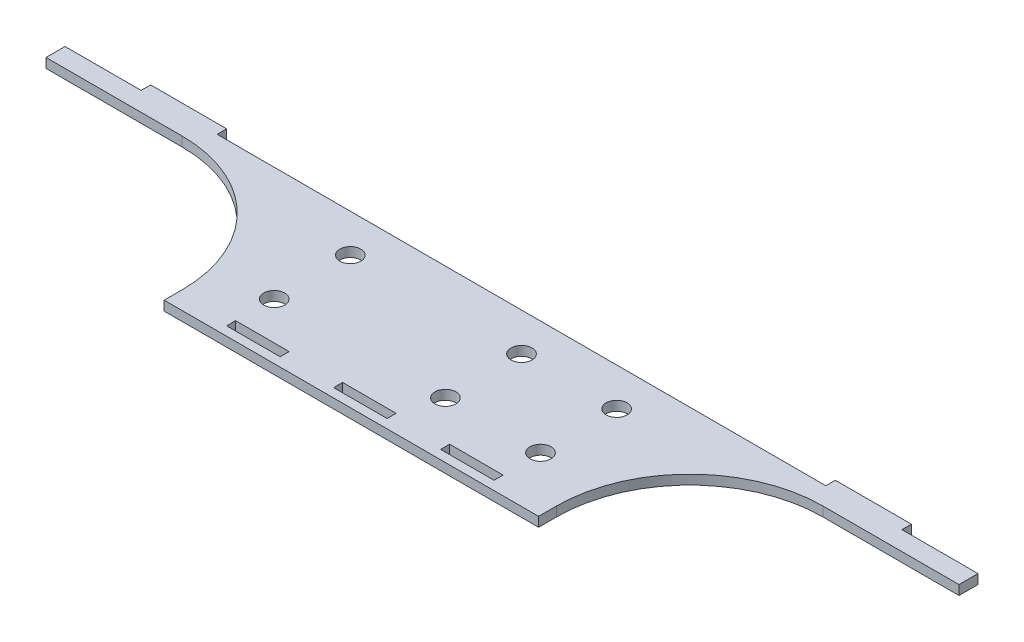
ISO-10303-21;
HEADER;
FILE_DESCRIPTION(('STEP AP214'),'2;1');
FILE_NAME('part.step','',(''),(''),'','','');
FILE_SCHEMA(('AUTOMOTIVE_DESIGN { 1 0 10303 214 1 1 1 1 }'));
ENDSEC;
DATA;
#1=APPLICATION_CONTEXT('core data for automotive mechanical design processes');
#2=APPLICATION_PROTOCOL_DEFINITION('international standard','automotive_design',2000,#1);
#3=PRODUCT_CONTEXT('',#1,'mechanical');
#4=PRODUCT('Part','Part','',(#3));
#5=PRODUCT_RELATED_PRODUCT_CATEGORY('part','',(#4));
#6=PRODUCT_DEFINITION_FORMATION('','',#4);
#7=PRODUCT_DEFINITION_CONTEXT('part definition',#1,'design');
#8=PRODUCT_DEFINITION('design','',#6,#7);
#9=PRODUCT_DEFINITION_SHAPE('','',#8);
#10=(LENGTH_UNIT() NAMED_UNIT(*) SI_UNIT(.MILLI.,.METRE.));
#11=(NAMED_UNIT(*) PLANE_ANGLE_UNIT() SI_UNIT($,.RADIAN.));
#12=(NAMED_UNIT(*) SI_UNIT($,.STERADIAN.) SOLID_ANGLE_UNIT());
#13=UNCERTAINTY_MEASURE_WITH_UNIT(LENGTH_MEASURE(1.E-05),#10,'distance_accuracy_value','');
#14=(GEOMETRIC_REPRESENTATION_CONTEXT(3) GLOBAL_UNCERTAINTY_ASSIGNED_CONTEXT((#13)) GLOBAL_UNIT_ASSIGNED_CONTEXT((#10,
#11,#12)) REPRESENTATION_CONTEXT('',''));
#15=CARTESIAN_POINT('',(0.,0.,0.));
#16=DIRECTION('',(0.,0.,1.));
#17=DIRECTION('',(1.,0.,0.));
#18=AXIS2_PLACEMENT_3D('',#15,#16,#17);
#19=CARTESIAN_POINT('',(106.95,3.175,25.4));
#20=DIRECTION('',(0.,-1.,0.));
#21=DIRECTION('',(0.,0.,-1.));
#22=AXIS2_PLACEMENT_3D('',#19,#20,#21);
#23=CYLINDRICAL_SURFACE('',#22,44.45);
#24=CARTESIAN_POINT('',(106.95,0.,25.4));
#25=DIRECTION('',(0.,1.,0.));
#26=DIRECTION('',(0.,0.,1.));
#27=AXIS2_PLACEMENT_3D('',#24,#25,#26);
#28=CIRCLE('',#27,44.45);
#29=CARTESIAN_POINT('',(106.95,0.,-19.05));
#30=VERTEX_POINT('',#29);
#31=CARTESIAN_POINT('',(62.5,0.,25.4));
#32=VERTEX_POINT('',#31);
#33=EDGE_CURVE('E329',#30,#32,#28,.T.);
#34=ORIENTED_EDGE('',*,*,#33,.F.);
#35=DIRECTION('',(0.,-1.,0.));
#36=VECTOR('',#35,1.);
#37=CARTESIAN_POINT('',(106.95,3.175,-19.05));
#38=LINE('',#37,#36);
#39=CARTESIAN_POINT('',(106.95,3.175,-19.05));
#40=VERTEX_POINT('',#39);
#41=EDGE_CURVE('E11',#40,#30,#38,.T.);
#42=ORIENTED_EDGE('',*,*,#41,.F.);
#43=CARTESIAN_POINT('',(106.95,3.175,25.4));
#44=DIRECTION('',(0.,1.,0.));
#45=DIRECTION('',(0.,0.,1.));
#46=AXIS2_PLACEMENT_3D('',#43,#44,#45);
#47=CIRCLE('',#46,44.45);
#48=CARTESIAN_POINT('',(62.5,3.175,25.4));
#49=VERTEX_POINT('',#48);
#50=EDGE_CURVE('E987',#40,#49,#47,.T.);
#51=ORIENTED_EDGE('',*,*,#50,.T.);
#52=DIRECTION('',(0.,-1.,0.));
#53=VECTOR('',#52,1.);
#54=CARTESIAN_POINT('',(62.5,3.175,25.4));
#55=LINE('',#54,#53);
#56=EDGE_CURVE('E161',#49,#32,#55,.T.);
#57=ORIENTED_EDGE('',*,*,#56,.T.);
#58=EDGE_LOOP('',(#34,#42,#51,#57));
#59=FACE_BOUND('',#58,.T.);
#60=ADVANCED_FACE('F41',(#59),#23,.F.);
#61=CARTESIAN_POINT('',(0.,3.175,-19.0499999999999));
#62=DIRECTION('',(0.,0.,1.));
#63=DIRECTION('',(1.,0.,0.));
#64=AXIS2_PLACEMENT_3D('',#61,#62,#63);
#65=PLANE('',#64);
#66=DIRECTION('',(-1.,0.,0.));
#67=VECTOR('',#66,1.);
#68=CARTESIAN_POINT('',(0.,0.,-19.0499999999999));
#69=LINE('',#68,#67);
#70=CARTESIAN_POINT('',(152.4,0.,-19.05));
#71=VERTEX_POINT('',#70);
#72=EDGE_CURVE('E331',#71,#30,#69,.T.);
#73=ORIENTED_EDGE('',*,*,#72,.F.);
#74=DIRECTION('',(0.,-1.,0.));
#75=VECTOR('',#74,1.);
#76=CARTESIAN_POINT('',(152.4,3.175,-19.05));
#77=LINE('',#76,#75);
#78=CARTESIAN_POINT('',(152.4,3.175,-19.05));
#79=VERTEX_POINT('',#78);
#80=EDGE_CURVE('E51',#79,#71,#77,.T.);
#81=ORIENTED_EDGE('',*,*,#80,.F.);
#82=DIRECTION('',(-1.,0.,0.));
#83=VECTOR('',#82,1.);
#84=CARTESIAN_POINT('',(0.,3.175,-19.0499999999999));
#85=LINE('',#84,#83);
#86=EDGE_CURVE('E593',#79,#40,#85,.T.);
#87=ORIENTED_EDGE('',*,*,#86,.T.);
#88=ORIENTED_EDGE('',*,*,#41,.T.);
#89=EDGE_LOOP('',(#73,#81,#87,#88));
#90=FACE_BOUND('',#89,.T.);
#91=ADVANCED_FACE('F456',(#90),#65,.T.);
#92=CARTESIAN_POINT('',(152.4,3.175,0.));
#93=DIRECTION('',(-1.,0.,0.));
#94=DIRECTION('',(0.,0.,1.));
#95=AXIS2_PLACEMENT_3D('',#92,#93,#94);
#96=PLANE('',#95);
#97=DIRECTION('',(0.,0.,-1.));
#98=VECTOR('',#97,1.);
#99=CARTESIAN_POINT('',(152.4,0.,0.));
#100=LINE('',#99,#98);
#101=CARTESIAN_POINT('',(152.4,0.,-25.4));
#102=VERTEX_POINT('',#101);
#103=EDGE_CURVE('E334',#71,#102,#100,.T.);
#104=ORIENTED_EDGE('',*,*,#103,.T.);
#105=DIRECTION('',(0.,-1.,0.));
#106=VECTOR('',#105,1.);
#107=CARTESIAN_POINT('',(152.4,3.175,-25.4));
#108=LINE('',#107,#106);
#109=CARTESIAN_POINT('',(152.4,3.175,-25.4));
#110=VERTEX_POINT('',#109);
#111=EDGE_CURVE('E400',#110,#102,#108,.T.);
#112=ORIENTED_EDGE('',*,*,#111,.F.);
#113=DIRECTION('',(0.,0.,-1.));
#114=VECTOR('',#113,1.);
#115=CARTESIAN_POINT('',(152.4,3.175,0.));
#116=LINE('',#115,#114);
#117=EDGE_CURVE('E587',#79,#110,#116,.T.);
#118=ORIENTED_EDGE('',*,*,#117,.F.);
#119=ORIENTED_EDGE('',*,*,#80,.T.);
#120=EDGE_LOOP('',(#104,#112,#118,#119));
#121=FACE_BOUND('',#120,.T.);
#122=ADVANCED_FACE('F461',(#121),#96,.F.);
#123=CARTESIAN_POINT('',(0.,3.175,-25.4));
#124=DIRECTION('',(0.,0.,-1.));
#125=DIRECTION('',(-1.,0.,0.));
#126=AXIS2_PLACEMENT_3D('',#123,#124,#125);
#127=PLANE('',#126);
#128=DIRECTION('',(1.,0.,0.));
#129=VECTOR('',#128,1.);
#130=CARTESIAN_POINT('',(0.,0.,-25.4));
#131=LINE('',#130,#129);
#132=CARTESIAN_POINT('',(127.,0.,-25.4));
#133=VERTEX_POINT('',#132);
#134=EDGE_CURVE('E337',#133,#102,#131,.T.);
#135=ORIENTED_EDGE('',*,*,#134,.F.);
#136=DIRECTION('',(0.,-1.,0.));
#137=VECTOR('',#136,1.);
#138=CARTESIAN_POINT('',(127.,3.175,-25.4));
#139=LINE('',#138,#137);
#140=CARTESIAN_POINT('',(127.,3.175,-25.4));
#141=VERTEX_POINT('',#140);
#142=EDGE_CURVE('E398',#141,#133,#139,.T.);
#143=ORIENTED_EDGE('',*,*,#142,.F.);
#144=DIRECTION('',(1.,0.,0.));
#145=VECTOR('',#144,1.);
#146=CARTESIAN_POINT('',(0.,3.175,-25.4));
#147=LINE('',#146,#145);
#148=EDGE_CURVE('E583',#141,#110,#147,.T.);
#149=ORIENTED_EDGE('',*,*,#148,.T.);
#150=ORIENTED_EDGE('',*,*,#111,.T.);
#151=EDGE_LOOP('',(#135,#143,#149,#150));
#152=FACE_BOUND('',#151,.T.);
#153=ADVANCED_FACE('F545',(#152),#127,.T.);
#154=CARTESIAN_POINT('',(127.,3.175,0.));
#155=DIRECTION('',(1.,0.,0.));
#156=DIRECTION('',(0.,0.,-1.));
#157=AXIS2_PLACEMENT_3D('',#154,#155,#156);
#158=PLANE('',#157);
#159=DIRECTION('',(0.,0.,1.));
#160=VECTOR('',#159,1.);
#161=CARTESIAN_POINT('',(127.,0.,0.));
#162=LINE('',#161,#160);
#163=CARTESIAN_POINT('',(127.,0.,-28.575));
#164=VERTEX_POINT('',#163);
#165=EDGE_CURVE('E340',#164,#133,#162,.T.);
#166=ORIENTED_EDGE('',*,*,#165,.F.);
#167=DIRECTION('',(0.,-1.,0.));
#168=VECTOR('',#167,1.);
#169=CARTESIAN_POINT('',(127.,3.175,-28.575));
#170=LINE('',#169,#168);
#171=CARTESIAN_POINT('',(127.,3.175,-28.575));
#172=VERTEX_POINT('',#171);
#173=EDGE_CURVE('E396',#172,#164,#170,.T.);
#174=ORIENTED_EDGE('',*,*,#173,.F.);
#175=DIRECTION('',(0.,0.,1.));
#176=VECTOR('',#175,1.);
#177=CARTESIAN_POINT('',(127.,3.175,0.));
#178=LINE('',#177,#176);
#179=EDGE_CURVE('E586',#172,#141,#178,.T.);
#180=ORIENTED_EDGE('',*,*,#179,.T.);
#181=ORIENTED_EDGE('',*,*,#142,.T.);
#182=EDGE_LOOP('',(#166,#174,#180,#181));
#183=FACE_BOUND('',#182,.T.);
#184=ADVANCED_FACE('F565',(#183),#158,.T.);
#185=CARTESIAN_POINT('',(0.,3.175,-28.575));
#186=DIRECTION('',(0.,0.,-1.));
#187=DIRECTION('',(-1.,0.,0.));
#188=AXIS2_PLACEMENT_3D('',#185,#186,#187);
#189=PLANE('',#188);
#190=DIRECTION('',(1.,0.,0.));
#191=VECTOR('',#190,1.);
#192=CARTESIAN_POINT('',(0.,0.,-28.575));
#193=LINE('',#192,#191);
#194=CARTESIAN_POINT('',(101.6,0.,-28.575));
#195=VERTEX_POINT('',#194);
#196=EDGE_CURVE('E345',#195,#164,#193,.T.);
#197=ORIENTED_EDGE('',*,*,#196,.F.);
#198=DIRECTION('',(0.,-1.,0.));
#199=VECTOR('',#198,1.);
#200=CARTESIAN_POINT('',(101.6,3.175,-28.575));
#201=LINE('',#200,#199);
#202=CARTESIAN_POINT('',(101.6,3.175,-28.575));
#203=VERTEX_POINT('',#202);
#204=EDGE_CURVE('E394',#203,#195,#201,.T.);
#205=ORIENTED_EDGE('',*,*,#204,.F.);
#206=DIRECTION('',(1.,0.,0.));
#207=VECTOR('',#206,1.);
#208=CARTESIAN_POINT('',(0.,3.175,-28.575));
#209=LINE('',#208,#207);
#210=EDGE_CURVE('E591',#203,#172,#209,.T.);
#211=ORIENTED_EDGE('',*,*,#210,.T.);
#212=ORIENTED_EDGE('',*,*,#173,.T.);
#213=EDGE_LOOP('',(#197,#205,#211,#212));
#214=FACE_BOUND('',#213,.T.);
#215=ADVANCED_FACE('F561',(#214),#189,.T.);
#216=CARTESIAN_POINT('',(101.6,3.175,0.));
#217=DIRECTION('',(1.,0.,0.));
#218=DIRECTION('',(0.,0.,-1.));
#219=AXIS2_PLACEMENT_3D('',#216,#217,#218);
#220=PLANE('',#219);
#221=DIRECTION('',(0.,0.,1.));
#222=VECTOR('',#221,1.);
#223=CARTESIAN_POINT('',(101.6,0.,0.));
#224=LINE('',#223,#222);
#225=CARTESIAN_POINT('',(101.6,0.,-25.4));
#226=VERTEX_POINT('',#225);
#227=EDGE_CURVE('E348',#195,#226,#224,.T.);
#228=ORIENTED_EDGE('',*,*,#227,.T.);
#229=DIRECTION('',(0.,-1.,0.));
#230=VECTOR('',#229,1.);
#231=CARTESIAN_POINT('',(101.6,3.175,-25.4));
#232=LINE('',#231,#230);
#233=CARTESIAN_POINT('',(101.6,3.175,-25.4));
#234=VERTEX_POINT('',#233);
#235=EDGE_CURVE('E392',#234,#226,#232,.T.);
#236=ORIENTED_EDGE('',*,*,#235,.F.);
#237=DIRECTION('',(0.,0.,1.));
#238=VECTOR('',#237,1.);
#239=CARTESIAN_POINT('',(101.6,3.175,0.));
#240=LINE('',#239,#238);
#241=EDGE_CURVE('E600',#203,#234,#240,.T.);
#242=ORIENTED_EDGE('',*,*,#241,.F.);
#243=ORIENTED_EDGE('',*,*,#204,.T.);
#244=EDGE_LOOP('',(#228,#236,#242,#243));
#245=FACE_BOUND('',#244,.T.);
#246=ADVANCED_FACE('F558',(#245),#220,.F.);
#247=CARTESIAN_POINT('',(-101.6,0.,-25.4));
#248=VERTEX_POINT('',#247);
#249=EDGE_CURVE('E342',#248,#226,#131,.T.);
#250=ORIENTED_EDGE('',*,*,#249,.F.);
#251=DIRECTION('',(0.,-1.,0.));
#252=VECTOR('',#251,1.);
#253=CARTESIAN_POINT('',(-101.6,3.175,-25.4));
#254=LINE('',#253,#252);
#255=CARTESIAN_POINT('',(-101.6,3.175,-25.4));
#256=VERTEX_POINT('',#255);
#257=EDGE_CURVE('E390',#256,#248,#254,.T.);
#258=ORIENTED_EDGE('',*,*,#257,.F.);
#259=EDGE_CURVE('E590',#256,#234,#147,.T.);
#260=ORIENTED_EDGE('',*,*,#259,.T.);
#261=ORIENTED_EDGE('',*,*,#235,.T.);
#262=EDGE_LOOP('',(#250,#258,#260,#261));
#263=FACE_BOUND('',#262,.T.);
#264=ADVANCED_FACE('F546',(#263),#127,.T.);
#265=CARTESIAN_POINT('',(-101.6,3.175,1.77635683940024E-12));
#266=DIRECTION('',(1.,0.,0.));
#267=DIRECTION('',(0.,0.,-1.));
#268=AXIS2_PLACEMENT_3D('',#265,#266,#267);
#269=PLANE('',#268);
#270=DIRECTION('',(0.,0.,1.));
#271=VECTOR('',#270,1.);
#272=CARTESIAN_POINT('',(-101.6,0.,1.77635683940024E-12));
#273=LINE('',#272,#271);
#274=CARTESIAN_POINT('',(-101.6,0.,-28.575));
#275=VERTEX_POINT('',#274);
#276=EDGE_CURVE('E351',#275,#248,#273,.T.);
#277=ORIENTED_EDGE('',*,*,#276,.F.);
#278=DIRECTION('',(0.,-1.,0.));
#279=VECTOR('',#278,1.);
#280=CARTESIAN_POINT('',(-101.6,3.175,-28.575));
#281=LINE('',#280,#279);
#282=CARTESIAN_POINT('',(-101.6,3.175,-28.575));
#283=VERTEX_POINT('',#282);
#284=EDGE_CURVE('E388',#283,#275,#281,.T.);
#285=ORIENTED_EDGE('',*,*,#284,.F.);
#286=DIRECTION('',(0.,0.,1.));
#287=VECTOR('',#286,1.);
#288=CARTESIAN_POINT('',(-101.6,3.175,1.77635683940024E-12));
#289=LINE('',#288,#287);
#290=EDGE_CURVE('E599',#283,#256,#289,.T.);
#291=ORIENTED_EDGE('',*,*,#290,.T.);
#292=ORIENTED_EDGE('',*,*,#257,.T.);
#293=EDGE_LOOP('',(#277,#285,#291,#292));
#294=FACE_BOUND('',#293,.T.);
#295=ADVANCED_FACE('F553',(#294),#269,.T.);
#296=CARTESIAN_POINT('',(0.,3.175,-28.575));
#297=DIRECTION('',(0.,0.,-1.));
#298=DIRECTION('',(-1.,0.,0.));
#299=AXIS2_PLACEMENT_3D('',#296,#297,#298);
#300=PLANE('',#299);
#301=DIRECTION('',(1.,0.,0.));
#302=VECTOR('',#301,1.);
#303=CARTESIAN_POINT('',(0.,0.,-28.575));
#304=LINE('',#303,#302);
#305=CARTESIAN_POINT('',(-127.,0.,-28.575));
#306=VERTEX_POINT('',#305);
#307=EDGE_CURVE('E354',#306,#275,#304,.T.);
#308=ORIENTED_EDGE('',*,*,#307,.F.);
#309=DIRECTION('',(0.,-1.,0.));
#310=VECTOR('',#309,1.);
#311=CARTESIAN_POINT('',(-127.,3.175,-28.575));
#312=LINE('',#311,#310);
#313=CARTESIAN_POINT('',(-127.,3.175,-28.575));
#314=VERTEX_POINT('',#313);
#315=EDGE_CURVE('E386',#314,#306,#312,.T.);
#316=ORIENTED_EDGE('',*,*,#315,.F.);
#317=DIRECTION('',(1.,0.,0.));
#318=VECTOR('',#317,1.);
#319=CARTESIAN_POINT('',(0.,3.175,-28.575));
#320=LINE('',#319,#318);
#321=EDGE_CURVE('E604',#314,#283,#320,.T.);
#322=ORIENTED_EDGE('',*,*,#321,.T.);
#323=ORIENTED_EDGE('',*,*,#284,.T.);
#324=EDGE_LOOP('',(#308,#316,#322,#323));
#325=FACE_BOUND('',#324,.T.);
#326=ADVANCED_FACE('F549',(#325),#300,.T.);
#327=CARTESIAN_POINT('',(-127.,3.175,1.11022302462515E-12));
#328=DIRECTION('',(1.,0.,0.));
#329=DIRECTION('',(0.,0.,-1.));
#330=AXIS2_PLACEMENT_3D('',#327,#328,#329);
#331=PLANE('',#330);
#332=DIRECTION('',(0.,0.,1.));
#333=VECTOR('',#332,1.);
#334=CARTESIAN_POINT('',(-127.,0.,1.11022302462515E-12));
#335=LINE('',#334,#333);
#336=CARTESIAN_POINT('',(-127.,0.,-25.4));
#337=VERTEX_POINT('',#336);
#338=EDGE_CURVE('E357',#306,#337,#335,.T.);
#339=ORIENTED_EDGE('',*,*,#338,.T.);
#340=DIRECTION('',(0.,-1.,0.));
#341=VECTOR('',#340,1.);
#342=CARTESIAN_POINT('',(-127.,3.175,-25.4));
#343=LINE('',#342,#341);
#344=CARTESIAN_POINT('',(-127.,3.175,-25.4));
#345=VERTEX_POINT('',#344);
#346=EDGE_CURVE('E384',#345,#337,#343,.T.);
#347=ORIENTED_EDGE('',*,*,#346,.F.);
#348=DIRECTION('',(0.,0.,1.));
#349=VECTOR('',#348,1.);
#350=CARTESIAN_POINT('',(-127.,3.175,1.11022302462515E-12));
#351=LINE('',#350,#349);
#352=EDGE_CURVE('E597',#314,#345,#351,.T.);
#353=ORIENTED_EDGE('',*,*,#352,.F.);
#354=ORIENTED_EDGE('',*,*,#315,.T.);
#355=EDGE_LOOP('',(#339,#347,#353,#354));
#356=FACE_BOUND('',#355,.T.);
#357=ADVANCED_FACE('F543',(#356),#331,.F.);
#358=CARTESIAN_POINT('',(-152.4,0.,-25.4));
#359=VERTEX_POINT('',#358);
#360=EDGE_CURVE('E341',#359,#337,#131,.T.);
#361=ORIENTED_EDGE('',*,*,#360,.F.);
#362=DIRECTION('',(0.,-1.,0.));
#363=VECTOR('',#362,1.);
#364=CARTESIAN_POINT('',(-152.4,3.175,-25.4));
#365=LINE('',#364,#363);
#366=CARTESIAN_POINT('',(-152.4,3.175,-25.4));
#367=VERTEX_POINT('',#366);
#368=EDGE_CURVE('E382',#367,#359,#365,.T.);
#369=ORIENTED_EDGE('',*,*,#368,.F.);
#370=EDGE_CURVE('E589',#367,#345,#147,.T.);
#371=ORIENTED_EDGE('',*,*,#370,.T.);
#372=ORIENTED_EDGE('',*,*,#346,.T.);
#373=EDGE_LOOP('',(#361,#369,#371,#372));
#374=FACE_BOUND('',#373,.T.);
#375=ADVANCED_FACE('F539',(#374),#127,.T.);
#376=CARTESIAN_POINT('',(-152.4,3.175,0.));
#377=DIRECTION('',(-1.,0.,0.));
#378=DIRECTION('',(0.,0.,1.));
#379=AXIS2_PLACEMENT_3D('',#376,#377,#378);
#380=PLANE('',#379);
#381=DIRECTION('',(0.,0.,-1.));
#382=VECTOR('',#381,1.);
#383=CARTESIAN_POINT('',(-152.4,0.,0.));
#384=LINE('',#383,#382);
#385=CARTESIAN_POINT('',(-152.4,0.,-19.05));
#386=VERTEX_POINT('',#385);
#387=EDGE_CURVE('E360',#386,#359,#384,.T.);
#388=ORIENTED_EDGE('',*,*,#387,.F.);
#389=DIRECTION('',(0.,-1.,0.));
#390=VECTOR('',#389,1.);
#391=CARTESIAN_POINT('',(-152.4,3.175,-19.05));
#392=LINE('',#391,#390);
#393=CARTESIAN_POINT('',(-152.4,3.175,-19.05));
#394=VERTEX_POINT('',#393);
#395=EDGE_CURVE('E380',#394,#386,#392,.T.);
#396=ORIENTED_EDGE('',*,*,#395,.F.);
#397=DIRECTION('',(0.,0.,-1.));
#398=VECTOR('',#397,1.);
#399=CARTESIAN_POINT('',(-152.4,3.175,0.));
#400=LINE('',#399,#398);
#401=EDGE_CURVE('E596',#394,#367,#400,.T.);
#402=ORIENTED_EDGE('',*,*,#401,.T.);
#403=ORIENTED_EDGE('',*,*,#368,.T.);
#404=EDGE_LOOP('',(#388,#396,#402,#403));
#405=FACE_BOUND('',#404,.T.);
#406=ADVANCED_FACE('F535',(#405),#380,.T.);
#407=CARTESIAN_POINT('',(0.,3.175,-19.05));
#408=DIRECTION('',(0.,0.,1.));
#409=DIRECTION('',(1.,0.,0.));
#410=AXIS2_PLACEMENT_3D('',#407,#408,#409);
#411=PLANE('',#410);
#412=DIRECTION('',(-1.,0.,0.));
#413=VECTOR('',#412,1.);
#414=CARTESIAN_POINT('',(0.,0.,-19.05));
#415=LINE('',#414,#413);
#416=CARTESIAN_POINT('',(-106.95,0.,-19.05));
#417=VERTEX_POINT('',#416);
#418=EDGE_CURVE('E363',#417,#386,#415,.T.);
#419=ORIENTED_EDGE('',*,*,#418,.F.);
#420=DIRECTION('',(0.,-1.,0.));
#421=VECTOR('',#420,1.);
#422=CARTESIAN_POINT('',(-106.95,3.175,-19.05));
#423=LINE('',#422,#421);
#424=CARTESIAN_POINT('',(-106.95,3.175,-19.05));
#425=VERTEX_POINT('',#424);
#426=EDGE_CURVE('E378',#425,#417,#423,.T.);
#427=ORIENTED_EDGE('',*,*,#426,.F.);
#428=DIRECTION('',(-1.,0.,0.));
#429=VECTOR('',#428,1.);
#430=CARTESIAN_POINT('',(0.,3.175,-19.05));
#431=LINE('',#430,#429);
#432=EDGE_CURVE('E273',#425,#394,#431,.T.);
#433=ORIENTED_EDGE('',*,*,#432,.T.);
#434=ORIENTED_EDGE('',*,*,#395,.T.);
#435=EDGE_LOOP('',(#419,#427,#433,#434));
#436=FACE_BOUND('',#435,.T.);
#437=ADVANCED_FACE('F531',(#436),#411,.T.);
#438=CARTESIAN_POINT('',(-106.95,3.175,25.4));
#439=DIRECTION('',(0.,-1.,0.));
#440=DIRECTION('',(0.,0.,-1.));
#441=AXIS2_PLACEMENT_3D('',#438,#439,#440);
#442=CYLINDRICAL_SURFACE('',#441,44.45);
#443=CARTESIAN_POINT('',(-106.95,0.,25.4));
#444=DIRECTION('',(0.,1.,0.));
#445=DIRECTION('',(0.,0.,1.));
#446=AXIS2_PLACEMENT_3D('',#443,#444,#445);
#447=CIRCLE('',#446,44.45);
#448=CARTESIAN_POINT('',(-62.5,0.,25.4));
#449=VERTEX_POINT('',#448);
#450=EDGE_CURVE('E366',#417,#449,#447,.F.);
#451=ORIENTED_EDGE('',*,*,#450,.T.);
#452=DIRECTION('',(0.,-1.,0.));
#453=VECTOR('',#452,1.);
#454=CARTESIAN_POINT('',(-62.5,3.175,25.4));
#455=LINE('',#454,#453);
#456=CARTESIAN_POINT('',(-62.5,3.175,25.4));
#457=VERTEX_POINT('',#456);
#458=EDGE_CURVE('E260',#457,#449,#455,.T.);
#459=ORIENTED_EDGE('',*,*,#458,.F.);
#460=CARTESIAN_POINT('',(-106.95,3.175,25.4));
#461=DIRECTION('',(0.,1.,0.));
#462=DIRECTION('',(0.,0.,1.));
#463=AXIS2_PLACEMENT_3D('',#460,#461,#462);
#464=CIRCLE('',#463,44.45);
#465=EDGE_CURVE('E270',#425,#457,#464,.F.);
#466=ORIENTED_EDGE('',*,*,#465,.F.);
#467=ORIENTED_EDGE('',*,*,#426,.T.);
#468=EDGE_LOOP('',(#451,#459,#466,#467));
#469=FACE_BOUND('',#468,.T.);
#470=ADVANCED_FACE('F528',(#469),#442,.F.);
#471=CARTESIAN_POINT('',(-62.4999999999999,3.175,-3.61400724161833E-13));
#472=DIRECTION('',(-1.,0.,0.));
#473=DIRECTION('',(0.,0.,1.));
#474=AXIS2_PLACEMENT_3D('',#471,#472,#473);
#475=PLANE('',#474);
#476=DIRECTION('',(0.,0.,-1.));
#477=VECTOR('',#476,1.);
#478=CARTESIAN_POINT('',(-62.4999999999999,0.,-3.61400724161833E-13));
#479=LINE('',#478,#477);
#480=CARTESIAN_POINT('',(-62.5,0.,31.4));
#481=VERTEX_POINT('',#480);
#482=EDGE_CURVE('E257',#481,#449,#479,.T.);
#483=ORIENTED_EDGE('',*,*,#482,.F.);
#484=DIRECTION('',(0.,-1.,0.));
#485=VECTOR('',#484,1.);
#486=CARTESIAN_POINT('',(-62.5,3.175,31.4));
#487=LINE('',#486,#485);
#488=CARTESIAN_POINT('',(-62.5,3.175,31.4));
#489=VERTEX_POINT('',#488);
#490=EDGE_CURVE('E251',#489,#481,#487,.T.);
#491=ORIENTED_EDGE('',*,*,#490,.F.);
#492=DIRECTION('',(0.,0.,-1.));
#493=VECTOR('',#492,1.);
#494=CARTESIAN_POINT('',(-62.4999999999999,3.175,-3.61400724161833E-13));
#495=LINE('',#494,#493);
#496=EDGE_CURVE('E255',#489,#457,#495,.T.);
#497=ORIENTED_EDGE('',*,*,#496,.T.);
#498=ORIENTED_EDGE('',*,*,#458,.T.);
#499=EDGE_LOOP('',(#483,#491,#497,#498));
#500=FACE_BOUND('',#499,.T.);
#501=ADVANCED_FACE('F253',(#500),#475,.T.);
#502=CARTESIAN_POINT('',(0.,3.175,31.4));
#503=DIRECTION('',(0.,0.,-1.));
#504=DIRECTION('',(-1.,0.,0.));
#505=AXIS2_PLACEMENT_3D('',#502,#503,#504);
#506=PLANE('',#505);
#507=DIRECTION('',(1.,0.,0.));
#508=VECTOR('',#507,1.);
#509=CARTESIAN_POINT('',(0.,0.,31.4));
#510=LINE('',#509,#508);
#511=CARTESIAN_POINT('',(62.5,0.,31.4));
#512=VERTEX_POINT('',#511);
#513=EDGE_CURVE('E370',#481,#512,#510,.T.);
#514=ORIENTED_EDGE('',*,*,#513,.T.);
#515=DIRECTION('',(0.,-1.,0.));
#516=VECTOR('',#515,1.);
#517=CARTESIAN_POINT('',(62.5,3.175,31.4));
#518=LINE('',#517,#516);
#519=CARTESIAN_POINT('',(62.5,3.175,31.4));
#520=VERTEX_POINT('',#519);
#521=EDGE_CURVE('E261',#520,#512,#518,.T.);
#522=ORIENTED_EDGE('',*,*,#521,.F.);
#523=DIRECTION('',(1.,0.,0.));
#524=VECTOR('',#523,1.);
#525=CARTESIAN_POINT('',(0.,3.175,31.4));
#526=LINE('',#525,#524);
#527=EDGE_CURVE('E264',#489,#520,#526,.T.);
#528=ORIENTED_EDGE('',*,*,#527,.F.);
#529=ORIENTED_EDGE('',*,*,#490,.T.);
#530=EDGE_LOOP('',(#514,#522,#528,#529));
#531=FACE_BOUND('',#530,.T.);
#532=ADVANCED_FACE('F265',(#531),#506,.F.);
#533=CARTESIAN_POINT('',(26.7857142857143,3.175,0.));
#534=DIRECTION('',(-1.,0.,0.));
#535=DIRECTION('',(0.,0.,1.));
#536=AXIS2_PLACEMENT_3D('',#533,#534,#535);
#537=PLANE('',#536);
#538=DIRECTION('',(0.,0.,-1.));
#539=VECTOR('',#538,1.);
#540=CARTESIAN_POINT('',(26.7857142857143,0.,0.));
#541=LINE('',#540,#539);
#542=CARTESIAN_POINT('',(26.7857142857143,0.,28.4));
#543=VERTEX_POINT('',#542);
#544=CARTESIAN_POINT('',(26.7857142857143,0.,25.4));
#545=VERTEX_POINT('',#544);
#546=EDGE_CURVE('E302',#543,#545,#541,.T.);
#547=ORIENTED_EDGE('',*,*,#546,.T.);
#548=DIRECTION('',(0.,-1.,0.));
#549=VECTOR('',#548,1.);
#550=CARTESIAN_POINT('',(26.7857142857143,3.175,25.4));
#551=LINE('',#550,#549);
#552=CARTESIAN_POINT('',(26.7857142857143,3.175,25.4));
#553=VERTEX_POINT('',#552);
#554=EDGE_CURVE('E375',#553,#545,#551,.T.);
#555=ORIENTED_EDGE('',*,*,#554,.F.);
#556=DIRECTION('',(0.,0.,-1.));
#557=VECTOR('',#556,1.);
#558=CARTESIAN_POINT('',(26.7857142857143,3.175,0.));
#559=LINE('',#558,#557);
#560=CARTESIAN_POINT('',(26.7857142857143,3.175,28.4));
#561=VERTEX_POINT('',#560);
#562=EDGE_CURVE('E953',#561,#553,#559,.T.);
#563=ORIENTED_EDGE('',*,*,#562,.F.);
#564=DIRECTION('',(0.,-1.,0.));
#565=VECTOR('',#564,1.);
#566=CARTESIAN_POINT('',(26.7857142857143,3.175,28.4));
#567=LINE('',#566,#565);
#568=EDGE_CURVE('E403',#561,#543,#567,.T.);
#569=ORIENTED_EDGE('',*,*,#568,.T.);
#570=EDGE_LOOP('',(#547,#555,#563,#569));
#571=FACE_BOUND('',#570,.T.);
#572=ADVANCED_FACE('F496',(#571),#537,.F.);
#573=CARTESIAN_POINT('',(0.,3.175,25.4));
#574=DIRECTION('',(0.,0.,-1.));
#575=DIRECTION('',(-1.,0.,0.));
#576=AXIS2_PLACEMENT_3D('',#573,#574,#575);
#577=PLANE('',#576);
#578=DIRECTION('',(1.,0.,0.));
#579=VECTOR('',#578,1.);
#580=CARTESIAN_POINT('',(0.,0.,25.4));
#581=LINE('',#580,#579);
#582=CARTESIAN_POINT('',(44.6428571428572,0.,25.4));
#583=VERTEX_POINT('',#582);
#584=EDGE_CURVE('E286',#545,#583,#581,.T.);
#585=ORIENTED_EDGE('',*,*,#584,.T.);
#586=DIRECTION('',(0.,-1.,0.));
#587=VECTOR('',#586,1.);
#588=CARTESIAN_POINT('',(44.6428571428572,3.175,25.4));
#589=LINE('',#588,#587);
#590=CARTESIAN_POINT('',(44.6428571428572,3.175,25.4));
#591=VERTEX_POINT('',#590);
#592=EDGE_CURVE('E408',#591,#583,#589,.T.);
#593=ORIENTED_EDGE('',*,*,#592,.F.);
#594=DIRECTION('',(1.,0.,0.));
#595=VECTOR('',#594,1.);
#596=CARTESIAN_POINT('',(0.,3.175,25.4));
#597=LINE('',#596,#595);
#598=EDGE_CURVE('E957',#553,#591,#597,.T.);
#599=ORIENTED_EDGE('',*,*,#598,.F.);
#600=ORIENTED_EDGE('',*,*,#554,.T.);
#601=EDGE_LOOP('',(#585,#593,#599,#600));
#602=FACE_BOUND('',#601,.T.);
#603=ADVANCED_FACE('F453',(#602),#577,.F.);
#604=CARTESIAN_POINT('',(44.6428571428572,3.175,0.));
#605=DIRECTION('',(-1.,0.,0.));
#606=DIRECTION('',(0.,0.,1.));
#607=AXIS2_PLACEMENT_3D('',#604,#605,#606);
#608=PLANE('',#607);
#609=DIRECTION('',(0.,0.,-1.));
#610=VECTOR('',#609,1.);
#611=CARTESIAN_POINT('',(44.6428571428572,0.,0.));
#612=LINE('',#611,#610);
#613=CARTESIAN_POINT('',(44.6428571428572,0.,28.4));
#614=VERTEX_POINT('',#613);
#615=EDGE_CURVE('E305',#614,#583,#612,.T.);
#616=ORIENTED_EDGE('',*,*,#615,.F.);
#617=DIRECTION('',(0.,-1.,0.));
#618=VECTOR('',#617,1.);
#619=CARTESIAN_POINT('',(44.6428571428572,3.175,28.4));
#620=LINE('',#619,#618);
#621=CARTESIAN_POINT('',(44.6428571428572,3.175,28.4));
#622=VERTEX_POINT('',#621);
#623=EDGE_CURVE('E405',#622,#614,#620,.T.);
#624=ORIENTED_EDGE('',*,*,#623,.F.);
#625=DIRECTION('',(0.,0.,-1.));
#626=VECTOR('',#625,1.);
#627=CARTESIAN_POINT('',(44.6428571428572,3.175,0.));
#628=LINE('',#627,#626);
#629=EDGE_CURVE('E963',#622,#591,#628,.T.);
#630=ORIENTED_EDGE('',*,*,#629,.T.);
#631=ORIENTED_EDGE('',*,*,#592,.T.);
#632=EDGE_LOOP('',(#616,#624,#630,#631));
#633=FACE_BOUND('',#632,.T.);
#634=ADVANCED_FACE('F490',(#633),#608,.T.);
#635=CARTESIAN_POINT('',(-8.92857142857143,3.175,0.));
#636=DIRECTION('',(-1.,0.,0.));
#637=DIRECTION('',(0.,0.,1.));
#638=AXIS2_PLACEMENT_3D('',#635,#636,#637);
#639=PLANE('',#638);
#640=DIRECTION('',(0.,0.,-1.));
#641=VECTOR('',#640,1.);
#642=CARTESIAN_POINT('',(-8.92857142857143,0.,0.));
#643=LINE('',#642,#641);
#644=CARTESIAN_POINT('',(-8.92857142857143,0.,28.4));
#645=VERTEX_POINT('',#644);
#646=CARTESIAN_POINT('',(-8.92857142857143,0.,25.4));
#647=VERTEX_POINT('',#646);
#648=EDGE_CURVE('E293',#645,#647,#643,.T.);
#649=ORIENTED_EDGE('',*,*,#648,.T.);
#650=DIRECTION('',(0.,-1.,0.));
#651=VECTOR('',#650,1.);
#652=CARTESIAN_POINT('',(-8.92857142857143,3.175,25.4));
#653=LINE('',#652,#651);
#654=CARTESIAN_POINT('',(-8.92857142857143,3.175,25.4));
#655=VERTEX_POINT('',#654);
#656=EDGE_CURVE('E406',#655,#647,#653,.T.);
#657=ORIENTED_EDGE('',*,*,#656,.F.);
#658=DIRECTION('',(0.,0.,-1.));
#659=VECTOR('',#658,1.);
#660=CARTESIAN_POINT('',(-8.92857142857143,3.175,0.));
#661=LINE('',#660,#659);
#662=CARTESIAN_POINT('',(-8.92857142857143,3.175,28.4));
#663=VERTEX_POINT('',#662);
#664=EDGE_CURVE('E955',#663,#655,#661,.T.);
#665=ORIENTED_EDGE('',*,*,#664,.F.);
#666=DIRECTION('',(0.,-1.,0.));
#667=VECTOR('',#666,1.);
#668=CARTESIAN_POINT('',(-8.92857142857143,3.175,28.4));
#669=LINE('',#668,#667);
#670=EDGE_CURVE('E412',#663,#645,#669,.T.);
#671=ORIENTED_EDGE('',*,*,#670,.T.);
#672=EDGE_LOOP('',(#649,#657,#665,#671));
#673=FACE_BOUND('',#672,.T.);
#674=ADVANCED_FACE('F492',(#673),#639,.F.);
#675=CARTESIAN_POINT('',(8.92857142857143,0.,25.4));
#676=VERTEX_POINT('',#675);
#677=EDGE_CURVE('E287',#647,#676,#581,.T.);
#678=ORIENTED_EDGE('',*,*,#677,.T.);
#679=DIRECTION('',(0.,-1.,0.));
#680=VECTOR('',#679,1.);
#681=CARTESIAN_POINT('',(8.92857142857143,3.175,25.4));
#682=LINE('',#681,#680);
#683=CARTESIAN_POINT('',(8.92857142857143,3.175,25.4));
#684=VERTEX_POINT('',#683);
#685=EDGE_CURVE('E416',#684,#676,#682,.T.);
#686=ORIENTED_EDGE('',*,*,#685,.F.);
#687=EDGE_CURVE('E951',#655,#684,#597,.T.);
#688=ORIENTED_EDGE('',*,*,#687,.F.);
#689=ORIENTED_EDGE('',*,*,#656,.T.);
#690=EDGE_LOOP('',(#678,#686,#688,#689));
#691=FACE_BOUND('',#690,.T.);
#692=ADVANCED_FACE('F452',(#691),#577,.F.);
#693=CARTESIAN_POINT('',(8.92857142857144,3.175,0.));
#694=DIRECTION('',(-1.,0.,0.));
#695=DIRECTION('',(0.,0.,1.));
#696=AXIS2_PLACEMENT_3D('',#693,#694,#695);
#697=PLANE('',#696);
#698=DIRECTION('',(0.,0.,-1.));
#699=VECTOR('',#698,1.);
#700=CARTESIAN_POINT('',(8.92857142857144,0.,0.));
#701=LINE('',#700,#699);
#702=CARTESIAN_POINT('',(8.92857142857143,0.,28.4));
#703=VERTEX_POINT('',#702);
#704=EDGE_CURVE('E296',#703,#676,#701,.T.);
#705=ORIENTED_EDGE('',*,*,#704,.F.);
#706=DIRECTION('',(0.,-1.,0.));
#707=VECTOR('',#706,1.);
#708=CARTESIAN_POINT('',(8.92857142857143,3.175,28.4));
#709=LINE('',#708,#707);
#710=CARTESIAN_POINT('',(8.92857142857143,3.175,28.4));
#711=VERTEX_POINT('',#710);
#712=EDGE_CURVE('E414',#711,#703,#709,.T.);
#713=ORIENTED_EDGE('',*,*,#712,.F.);
#714=DIRECTION('',(0.,0.,-1.));
#715=VECTOR('',#714,1.);
#716=CARTESIAN_POINT('',(8.92857142857144,3.175,0.));
#717=LINE('',#716,#715);
#718=EDGE_CURVE('E946',#711,#684,#717,.T.);
#719=ORIENTED_EDGE('',*,*,#718,.T.);
#720=ORIENTED_EDGE('',*,*,#685,.T.);
#721=EDGE_LOOP('',(#705,#713,#719,#720));
#722=FACE_BOUND('',#721,.T.);
#723=ADVANCED_FACE('F504',(#722),#697,.T.);
#724=CARTESIAN_POINT('',(-44.6428571428572,3.175,0.));
#725=DIRECTION('',(-1.,0.,0.));
#726=DIRECTION('',(0.,0.,1.));
#727=AXIS2_PLACEMENT_3D('',#724,#725,#726);
#728=PLANE('',#727);
#729=DIRECTION('',(0.,0.,-1.));
#730=VECTOR('',#729,1.);
#731=CARTESIAN_POINT('',(-44.6428571428572,0.,0.));
#732=LINE('',#731,#730);
#733=CARTESIAN_POINT('',(-44.6428571428572,0.,28.4));
#734=VERTEX_POINT('',#733);
#735=CARTESIAN_POINT('',(-44.6428571428572,0.,25.4));
#736=VERTEX_POINT('',#735);
#737=EDGE_CURVE('E279',#734,#736,#732,.T.);
#738=ORIENTED_EDGE('',*,*,#737,.T.);
#739=DIRECTION('',(0.,-1.,0.));
#740=VECTOR('',#739,1.);
#741=CARTESIAN_POINT('',(-44.6428571428572,3.175,25.4));
#742=LINE('',#741,#740);
#743=CARTESIAN_POINT('',(-44.6428571428572,3.175,25.4));
#744=VERTEX_POINT('',#743);
#745=EDGE_CURVE('E45',#744,#736,#742,.T.);
#746=ORIENTED_EDGE('',*,*,#745,.F.);
#747=DIRECTION('',(0.,0.,-1.));
#748=VECTOR('',#747,1.);
#749=CARTESIAN_POINT('',(-44.6428571428572,3.175,0.));
#750=LINE('',#749,#748);
#751=CARTESIAN_POINT('',(-44.6428571428572,3.175,28.4));
#752=VERTEX_POINT('',#751);
#753=EDGE_CURVE('E373',#752,#744,#750,.T.);
#754=ORIENTED_EDGE('',*,*,#753,.F.);
#755=DIRECTION('',(0.,-1.,0.));
#756=VECTOR('',#755,1.);
#757=CARTESIAN_POINT('',(-44.6428571428572,3.175,28.4));
#758=LINE('',#757,#756);
#759=EDGE_CURVE('E278',#752,#734,#758,.T.);
#760=ORIENTED_EDGE('',*,*,#759,.T.);
#761=EDGE_LOOP('',(#738,#746,#754,#760));
#762=FACE_BOUND('',#761,.T.);
#763=ADVANCED_FACE('F43',(#762),#728,.F.);
#764=CARTESIAN_POINT('',(-26.7857142857143,0.,25.4));
#765=VERTEX_POINT('',#764);
#766=EDGE_CURVE('E282',#736,#765,#581,.T.);
#767=ORIENTED_EDGE('',*,*,#766,.T.);
#768=DIRECTION('',(0.,-1.,0.));
#769=VECTOR('',#768,1.);
#770=CARTESIAN_POINT('',(-26.7857142857143,3.175,25.4));
#771=LINE('',#770,#769);
#772=CARTESIAN_POINT('',(-26.7857142857143,3.175,25.4));
#773=VERTEX_POINT('',#772);
#774=EDGE_CURVE('E422',#773,#765,#771,.T.);
#775=ORIENTED_EDGE('',*,*,#774,.F.);
#776=EDGE_CURVE('E169',#744,#773,#597,.T.);
#777=ORIENTED_EDGE('',*,*,#776,.F.);
#778=ORIENTED_EDGE('',*,*,#745,.T.);
#779=EDGE_LOOP('',(#767,#775,#777,#778));
#780=FACE_BOUND('',#779,.T.);
#781=ADVANCED_FACE('F427',(#780),#577,.F.);
#782=CARTESIAN_POINT('',(-26.7857142857143,3.175,0.));
#783=DIRECTION('',(-1.,0.,0.));
#784=DIRECTION('',(0.,0.,1.));
#785=AXIS2_PLACEMENT_3D('',#782,#783,#784);
#786=PLANE('',#785);
#787=DIRECTION('',(0.,0.,-1.));
#788=VECTOR('',#787,1.);
#789=CARTESIAN_POINT('',(-26.7857142857143,0.,0.));
#790=LINE('',#789,#788);
#791=CARTESIAN_POINT('',(-26.7857142857143,0.,28.4));
#792=VERTEX_POINT('',#791);
#793=EDGE_CURVE('E285',#792,#765,#790,.T.);
#794=ORIENTED_EDGE('',*,*,#793,.F.);
#795=DIRECTION('',(0.,-1.,0.));
#796=VECTOR('',#795,1.);
#797=CARTESIAN_POINT('',(-26.7857142857143,3.175,28.4));
#798=LINE('',#797,#796);
#799=CARTESIAN_POINT('',(-26.7857142857143,3.175,28.4));
#800=VERTEX_POINT('',#799);
#801=EDGE_CURVE('E421',#800,#792,#798,.T.);
#802=ORIENTED_EDGE('',*,*,#801,.F.);
#803=DIRECTION('',(0.,0.,-1.));
#804=VECTOR('',#803,1.);
#805=CARTESIAN_POINT('',(-26.7857142857143,3.175,0.));
#806=LINE('',#805,#804);
#807=EDGE_CURVE('E1033',#800,#773,#806,.T.);
#808=ORIENTED_EDGE('',*,*,#807,.T.);
#809=ORIENTED_EDGE('',*,*,#774,.T.);
#810=EDGE_LOOP('',(#794,#802,#808,#809));
#811=FACE_BOUND('',#810,.T.);
#812=ADVANCED_FACE('F441',(#811),#786,.T.);
#813=CARTESIAN_POINT('',(-44.45,3.175,-12.7));
#814=DIRECTION('',(0.,-1.,0.));
#815=DIRECTION('',(0.,0.,-1.));
#816=AXIS2_PLACEMENT_3D('',#813,#814,#815);
#817=CYLINDRICAL_SURFACE('',#816,3.5);
#818=CARTESIAN_POINT('',(-44.45,3.175,-12.7));
#819=DIRECTION('',(0.,1.,0.));
#820=DIRECTION('',(0.,0.,1.));
#821=AXIS2_PLACEMENT_3D('',#818,#819,#820);
#822=CIRCLE('',#821,3.5);
#823=CARTESIAN_POINT('',(-44.45,3.175,-9.2));
#824=VERTEX_POINT('',#823);
#825=EDGE_CURVE('E984',#824,#824,#822,.T.);
#826=ORIENTED_EDGE('',*,*,#825,.T.);
#827=EDGE_LOOP('',(#826));
#828=FACE_BOUND('',#827,.T.);
#829=CARTESIAN_POINT('',(-44.45,0.,-12.7));
#830=DIRECTION('',(0.,1.,0.));
#831=DIRECTION('',(0.,0.,1.));
#832=AXIS2_PLACEMENT_3D('',#829,#830,#831);
#833=CIRCLE('',#832,3.5);
#834=CARTESIAN_POINT('',(-44.45,0.,-9.2));
#835=VERTEX_POINT('',#834);
#836=EDGE_CURVE('E326',#835,#835,#833,.T.);
#837=ORIENTED_EDGE('',*,*,#836,.F.);
#838=EDGE_LOOP('',(#837));
#839=FACE_BOUND('',#838,.T.);
#840=ADVANCED_FACE('F443',(#828,#839),#817,.F.);
#841=CARTESIAN_POINT('',(-44.45,3.175,12.7));
#842=DIRECTION('',(0.,-1.,0.));
#843=DIRECTION('',(0.,0.,-1.));
#844=AXIS2_PLACEMENT_3D('',#841,#842,#843);
#845=CYLINDRICAL_SURFACE('',#844,3.5);
#846=CARTESIAN_POINT('',(-44.45,3.175,12.7));
#847=DIRECTION('',(0.,1.,0.));
#848=DIRECTION('',(0.,0.,1.));
#849=AXIS2_PLACEMENT_3D('',#846,#847,#848);
#850=CIRCLE('',#849,3.5);
#851=CARTESIAN_POINT('',(-44.45,3.175,16.2));
#852=VERTEX_POINT('',#851);
#853=EDGE_CURVE('E981',#852,#852,#850,.T.);
#854=ORIENTED_EDGE('',*,*,#853,.T.);
#855=EDGE_LOOP('',(#854));
#856=FACE_BOUND('',#855,.T.);
#857=CARTESIAN_POINT('',(-44.45,0.,12.7));
#858=DIRECTION('',(0.,1.,0.));
#859=DIRECTION('',(0.,0.,1.));
#860=AXIS2_PLACEMENT_3D('',#857,#858,#859);
#861=CIRCLE('',#860,3.5);
#862=CARTESIAN_POINT('',(-44.45,0.,16.2));
#863=VERTEX_POINT('',#862);
#864=EDGE_CURVE('E323',#863,#863,#861,.T.);
#865=ORIENTED_EDGE('',*,*,#864,.F.);
#866=EDGE_LOOP('',(#865));
#867=FACE_BOUND('',#866,.T.);
#868=ADVANCED_FACE('F448',(#856,#867),#845,.F.);
#869=CARTESIAN_POINT('',(44.45,3.175,-12.7));
#870=DIRECTION('',(0.,-1.,0.));
#871=DIRECTION('',(0.,0.,-1.));
#872=AXIS2_PLACEMENT_3D('',#869,#870,#871);
#873=CYLINDRICAL_SURFACE('',#872,3.5);
#874=CARTESIAN_POINT('',(44.45,3.175,-12.7));
#875=DIRECTION('',(0.,1.,0.));
#876=DIRECTION('',(0.,0.,1.));
#877=AXIS2_PLACEMENT_3D('',#874,#875,#876);
#878=CIRCLE('',#877,3.5);
#879=CARTESIAN_POINT('',(44.45,3.175,-9.2));
#880=VERTEX_POINT('',#879);
#881=EDGE_CURVE('E978',#880,#880,#878,.T.);
#882=ORIENTED_EDGE('',*,*,#881,.T.);
#883=EDGE_LOOP('',(#882));
#884=FACE_BOUND('',#883,.T.);
#885=CARTESIAN_POINT('',(44.45,0.,-12.7));
#886=DIRECTION('',(0.,1.,0.));
#887=DIRECTION('',(0.,0.,1.));
#888=AXIS2_PLACEMENT_3D('',#885,#886,#887);
#889=CIRCLE('',#888,3.5);
#890=CARTESIAN_POINT('',(44.45,0.,-9.2));
#891=VERTEX_POINT('',#890);
#892=EDGE_CURVE('E320',#891,#891,#889,.T.);
#893=ORIENTED_EDGE('',*,*,#892,.F.);
#894=EDGE_LOOP('',(#893));
#895=FACE_BOUND('',#894,.T.);
#896=ADVANCED_FACE('F468',(#884,#895),#873,.F.);
#897=CARTESIAN_POINT('',(44.45,3.175,12.7));
#898=DIRECTION('',(0.,-1.,0.));
#899=DIRECTION('',(0.,0.,-1.));
#900=AXIS2_PLACEMENT_3D('',#897,#898,#899);
#901=CYLINDRICAL_SURFACE('',#900,3.5);
#902=CARTESIAN_POINT('',(44.45,3.175,12.7));
#903=DIRECTION('',(0.,1.,0.));
#904=DIRECTION('',(0.,0.,1.));
#905=AXIS2_PLACEMENT_3D('',#902,#903,#904);
#906=CIRCLE('',#905,3.5);
#907=CARTESIAN_POINT('',(44.45,3.175,16.2));
#908=VERTEX_POINT('',#907);
#909=EDGE_CURVE('E975',#908,#908,#906,.T.);
#910=ORIENTED_EDGE('',*,*,#909,.T.);
#911=EDGE_LOOP('',(#910));
#912=FACE_BOUND('',#911,.T.);
#913=CARTESIAN_POINT('',(44.45,0.,12.7));
#914=DIRECTION('',(0.,1.,0.));
#915=DIRECTION('',(0.,0.,1.));
#916=AXIS2_PLACEMENT_3D('',#913,#914,#915);
#917=CIRCLE('',#916,3.5);
#918=CARTESIAN_POINT('',(44.45,0.,16.2));
#919=VERTEX_POINT('',#918);
#920=EDGE_CURVE('E317',#919,#919,#917,.T.);
#921=ORIENTED_EDGE('',*,*,#920,.F.);
#922=EDGE_LOOP('',(#921));
#923=FACE_BOUND('',#922,.T.);
#924=ADVANCED_FACE('F472',(#912,#923),#901,.F.);
#925=CARTESIAN_POINT('',(12.7,3.175,-12.7));
#926=DIRECTION('',(0.,-1.,0.));
#927=DIRECTION('',(0.,0.,-1.));
#928=AXIS2_PLACEMENT_3D('',#925,#926,#927);
#929=CYLINDRICAL_SURFACE('',#928,3.5);
#930=CARTESIAN_POINT('',(12.7,3.175,-12.7));
#931=DIRECTION('',(0.,1.,0.));
#932=DIRECTION('',(0.,0.,1.));
#933=AXIS2_PLACEMENT_3D('',#930,#931,#932);
#934=CIRCLE('',#933,3.5);
#935=CARTESIAN_POINT('',(12.7,3.175,-9.2));
#936=VERTEX_POINT('',#935);
#937=EDGE_CURVE('E972',#936,#936,#934,.T.);
#938=ORIENTED_EDGE('',*,*,#937,.T.);
#939=EDGE_LOOP('',(#938));
#940=FACE_BOUND('',#939,.T.);
#941=CARTESIAN_POINT('',(12.7,0.,-12.7));
#942=DIRECTION('',(0.,1.,0.));
#943=DIRECTION('',(0.,0.,1.));
#944=AXIS2_PLACEMENT_3D('',#941,#942,#943);
#945=CIRCLE('',#944,3.5);
#946=CARTESIAN_POINT('',(12.7,0.,-9.2));
#947=VERTEX_POINT('',#946);
#948=EDGE_CURVE('E314',#947,#947,#945,.T.);
#949=ORIENTED_EDGE('',*,*,#948,.F.);
#950=EDGE_LOOP('',(#949));
#951=FACE_BOUND('',#950,.T.);
#952=ADVANCED_FACE('F476',(#940,#951),#929,.F.);
#953=CARTESIAN_POINT('',(12.7,3.175,12.7));
#954=DIRECTION('',(0.,-1.,0.));
#955=DIRECTION('',(0.,0.,-1.));
#956=AXIS2_PLACEMENT_3D('',#953,#954,#955);
#957=CYLINDRICAL_SURFACE('',#956,3.5);
#958=CARTESIAN_POINT('',(12.7,3.175,12.7));
#959=DIRECTION('',(0.,1.,0.));
#960=DIRECTION('',(0.,0.,1.));
#961=AXIS2_PLACEMENT_3D('',#958,#959,#960);
#962=CIRCLE('',#961,3.5);
#963=CARTESIAN_POINT('',(12.7,3.175,16.2));
#964=VERTEX_POINT('',#963);
#965=EDGE_CURVE('E969',#964,#964,#962,.T.);
#966=ORIENTED_EDGE('',*,*,#965,.T.);
#967=EDGE_LOOP('',(#966));
#968=FACE_BOUND('',#967,.T.);
#969=CARTESIAN_POINT('',(12.7,0.,12.7));
#970=DIRECTION('',(0.,1.,0.));
#971=DIRECTION('',(0.,0.,1.));
#972=AXIS2_PLACEMENT_3D('',#969,#970,#971);
#973=CIRCLE('',#972,3.5);
#974=CARTESIAN_POINT('',(12.7,0.,16.2));
#975=VERTEX_POINT('',#974);
#976=EDGE_CURVE('E311',#975,#975,#973,.T.);
#977=ORIENTED_EDGE('',*,*,#976,.F.);
#978=EDGE_LOOP('',(#977));
#979=FACE_BOUND('',#978,.T.);
#980=ADVANCED_FACE('F480',(#968,#979),#957,.F.);
#981=CARTESIAN_POINT('',(0.,3.175,28.4));
#982=DIRECTION('',(0.,0.,-1.));
#983=DIRECTION('',(-1.,0.,0.));
#984=AXIS2_PLACEMENT_3D('',#981,#982,#983);
#985=PLANE('',#984);
#986=DIRECTION('',(1.,0.,0.));
#987=VECTOR('',#986,1.);
#988=CARTESIAN_POINT('',(0.,0.,28.4));
#989=LINE('',#988,#987);
#990=EDGE_CURVE('E308',#543,#614,#989,.T.);
#991=ORIENTED_EDGE('',*,*,#990,.F.);
#992=ORIENTED_EDGE('',*,*,#568,.F.);
#993=DIRECTION('',(1.,0.,0.));
#994=VECTOR('',#993,1.);
#995=CARTESIAN_POINT('',(0.,3.175,28.4));
#996=LINE('',#995,#994);
#997=EDGE_CURVE('E966',#561,#622,#996,.T.);
#998=ORIENTED_EDGE('',*,*,#997,.T.);
#999=ORIENTED_EDGE('',*,*,#623,.T.);
#1000=EDGE_LOOP('',(#991,#992,#998,#999));
#1001=FACE_BOUND('',#1000,.T.);
#1002=ADVANCED_FACE('F484',(#1001),#985,.T.);
#1003=CARTESIAN_POINT('',(0.,3.175,28.4));
#1004=DIRECTION('',(0.,0.,-1.));
#1005=DIRECTION('',(-1.,0.,0.));
#1006=AXIS2_PLACEMENT_3D('',#1003,#1004,#1005);
#1007=PLANE('',#1006);
#1008=DIRECTION('',(1.,0.,0.));
#1009=VECTOR('',#1008,1.);
#1010=CARTESIAN_POINT('',(0.,0.,28.4));
#1011=LINE('',#1010,#1009);
#1012=EDGE_CURVE('E299',#645,#703,#1011,.T.);
#1013=ORIENTED_EDGE('',*,*,#1012,.F.);
#1014=ORIENTED_EDGE('',*,*,#670,.F.);
#1015=DIRECTION('',(1.,0.,0.));
#1016=VECTOR('',#1015,1.);
#1017=CARTESIAN_POINT('',(0.,3.175,28.4));
#1018=LINE('',#1017,#1016);
#1019=EDGE_CURVE('E950',#663,#711,#1018,.T.);
#1020=ORIENTED_EDGE('',*,*,#1019,.T.);
#1021=ORIENTED_EDGE('',*,*,#712,.T.);
#1022=EDGE_LOOP('',(#1013,#1014,#1020,#1021));
#1023=FACE_BOUND('',#1022,.T.);
#1024=ADVANCED_FACE('F488',(#1023),#1007,.T.);
#1025=CARTESIAN_POINT('',(0.,3.175,28.4));
#1026=DIRECTION('',(0.,0.,-1.));
#1027=DIRECTION('',(-1.,0.,0.));
#1028=AXIS2_PLACEMENT_3D('',#1025,#1026,#1027);
#1029=PLANE('',#1028);
#1030=DIRECTION('',(1.,0.,0.));
#1031=VECTOR('',#1030,1.);
#1032=CARTESIAN_POINT('',(0.,0.,28.4));
#1033=LINE('',#1032,#1031);
#1034=EDGE_CURVE('E290',#734,#792,#1033,.T.);
#1035=ORIENTED_EDGE('',*,*,#1034,.F.);
#1036=ORIENTED_EDGE('',*,*,#759,.F.);
#1037=DIRECTION('',(1.,0.,0.));
#1038=VECTOR('',#1037,1.);
#1039=CARTESIAN_POINT('',(0.,3.175,28.4));
#1040=LINE('',#1039,#1038);
#1041=EDGE_CURVE('E439',#752,#800,#1040,.T.);
#1042=ORIENTED_EDGE('',*,*,#1041,.T.);
#1043=ORIENTED_EDGE('',*,*,#801,.T.);
#1044=EDGE_LOOP('',(#1035,#1036,#1042,#1043));
#1045=FACE_BOUND('',#1044,.T.);
#1046=ADVANCED_FACE('F436',(#1045),#1029,.T.);
#1047=CARTESIAN_POINT('',(62.5000000000001,3.175,2.16840434497101E-13));
#1048=DIRECTION('',(-1.,0.,0.));
#1049=DIRECTION('',(0.,0.,1.));
#1050=AXIS2_PLACEMENT_3D('',#1047,#1048,#1049);
#1051=PLANE('',#1050);
#1052=DIRECTION('',(0.,0.,-1.));
#1053=VECTOR('',#1052,1.);
#1054=CARTESIAN_POINT('',(62.5000000000001,0.,2.16840434497101E-13));
#1055=LINE('',#1054,#1053);
#1056=EDGE_CURVE('E154',#512,#32,#1055,.T.);
#1057=ORIENTED_EDGE('',*,*,#1056,.T.);
#1058=ORIENTED_EDGE('',*,*,#56,.F.);
#1059=DIRECTION('',(0.,0.,-1.));
#1060=VECTOR('',#1059,1.);
#1061=CARTESIAN_POINT('',(62.5000000000001,3.175,2.16840434497101E-13));
#1062=LINE('',#1061,#1060);
#1063=EDGE_CURVE('E60',#520,#49,#1062,.T.);
#1064=ORIENTED_EDGE('',*,*,#1063,.F.);
#1065=ORIENTED_EDGE('',*,*,#521,.T.);
#1066=EDGE_LOOP('',(#1057,#1058,#1064,#1065));
#1067=FACE_BOUND('',#1066,.T.);
#1068=ADVANCED_FACE('F511',(#1067),#1051,.F.);
#1069=CARTESIAN_POINT('',(0.,3.175,0.));
#1070=DIRECTION('',(0.,1.,0.));
#1071=DIRECTION('',(0.,0.,1.));
#1072=AXIS2_PLACEMENT_3D('',#1069,#1070,#1071);
#1073=PLANE('',#1072);
#1074=ORIENTED_EDGE('',*,*,#753,.T.);
#1075=ORIENTED_EDGE('',*,*,#776,.T.);
#1076=ORIENTED_EDGE('',*,*,#807,.F.);
#1077=ORIENTED_EDGE('',*,*,#1041,.F.);
#1078=EDGE_LOOP('',(#1074,#1075,#1076,#1077));
#1079=FACE_BOUND('',#1078,.T.);
#1080=ORIENTED_EDGE('',*,*,#664,.T.);
#1081=ORIENTED_EDGE('',*,*,#687,.T.);
#1082=ORIENTED_EDGE('',*,*,#718,.F.);
#1083=ORIENTED_EDGE('',*,*,#1019,.F.);
#1084=EDGE_LOOP('',(#1080,#1081,#1082,#1083));
#1085=FACE_BOUND('',#1084,.T.);
#1086=ORIENTED_EDGE('',*,*,#562,.T.);
#1087=ORIENTED_EDGE('',*,*,#598,.T.);
#1088=ORIENTED_EDGE('',*,*,#629,.F.);
#1089=ORIENTED_EDGE('',*,*,#997,.F.);
#1090=EDGE_LOOP('',(#1086,#1087,#1088,#1089));
#1091=FACE_BOUND('',#1090,.T.);
#1092=ORIENTED_EDGE('',*,*,#965,.F.);
#1093=EDGE_LOOP('',(#1092));
#1094=FACE_BOUND('',#1093,.T.);
#1095=ORIENTED_EDGE('',*,*,#937,.F.);
#1096=EDGE_LOOP('',(#1095));
#1097=FACE_BOUND('',#1096,.T.);
#1098=ORIENTED_EDGE('',*,*,#909,.F.);
#1099=EDGE_LOOP('',(#1098));
#1100=FACE_BOUND('',#1099,.T.);
#1101=ORIENTED_EDGE('',*,*,#881,.F.);
#1102=EDGE_LOOP('',(#1101));
#1103=FACE_BOUND('',#1102,.T.);
#1104=ORIENTED_EDGE('',*,*,#853,.F.);
#1105=EDGE_LOOP('',(#1104));
#1106=FACE_BOUND('',#1105,.T.);
#1107=ORIENTED_EDGE('',*,*,#825,.F.);
#1108=EDGE_LOOP('',(#1107));
#1109=FACE_BOUND('',#1108,.T.);
#1110=ORIENTED_EDGE('',*,*,#50,.F.);
#1111=ORIENTED_EDGE('',*,*,#86,.F.);
#1112=ORIENTED_EDGE('',*,*,#117,.T.);
#1113=ORIENTED_EDGE('',*,*,#148,.F.);
#1114=ORIENTED_EDGE('',*,*,#179,.F.);
#1115=ORIENTED_EDGE('',*,*,#210,.F.);
#1116=ORIENTED_EDGE('',*,*,#241,.T.);
#1117=ORIENTED_EDGE('',*,*,#259,.F.);
#1118=ORIENTED_EDGE('',*,*,#290,.F.);
#1119=ORIENTED_EDGE('',*,*,#321,.F.);
#1120=ORIENTED_EDGE('',*,*,#352,.T.);
#1121=ORIENTED_EDGE('',*,*,#370,.F.);
#1122=ORIENTED_EDGE('',*,*,#401,.F.);
#1123=ORIENTED_EDGE('',*,*,#432,.F.);
#1124=ORIENTED_EDGE('',*,*,#465,.T.);
#1125=ORIENTED_EDGE('',*,*,#496,.F.);
#1126=ORIENTED_EDGE('',*,*,#527,.T.);
#1127=ORIENTED_EDGE('',*,*,#1063,.T.);
#1128=EDGE_LOOP('',(#1110,#1111,#1112,#1113,#1114,#1115,#1116,#1117,#1118,#1119,#1120,#1121,
#1122,#1123,#1124,#1125,#1126,#1127));
#1129=FACE_BOUND('',#1128,.T.);
#1130=ADVANCED_FACE('F267',(#1079,#1085,#1091,#1094,#1097,#1100,#1103,#1106,#1109,#1129),#1073,.T.);
#1131=CARTESIAN_POINT('',(0.,0.,0.));
#1132=DIRECTION('',(0.,1.,0.));
#1133=DIRECTION('',(0.,0.,1.));
#1134=AXIS2_PLACEMENT_3D('',#1131,#1132,#1133);
#1135=PLANE('',#1134);
#1136=ORIENTED_EDGE('',*,*,#737,.F.);
#1137=ORIENTED_EDGE('',*,*,#1034,.T.);
#1138=ORIENTED_EDGE('',*,*,#793,.T.);
#1139=ORIENTED_EDGE('',*,*,#766,.F.);
#1140=EDGE_LOOP('',(#1136,#1137,#1138,#1139));
#1141=FACE_BOUND('',#1140,.T.);
#1142=ORIENTED_EDGE('',*,*,#648,.F.);
#1143=ORIENTED_EDGE('',*,*,#1012,.T.);
#1144=ORIENTED_EDGE('',*,*,#704,.T.);
#1145=ORIENTED_EDGE('',*,*,#677,.F.);
#1146=EDGE_LOOP('',(#1142,#1143,#1144,#1145));
#1147=FACE_BOUND('',#1146,.T.);
#1148=ORIENTED_EDGE('',*,*,#546,.F.);
#1149=ORIENTED_EDGE('',*,*,#990,.T.);
#1150=ORIENTED_EDGE('',*,*,#615,.T.);
#1151=ORIENTED_EDGE('',*,*,#584,.F.);
#1152=EDGE_LOOP('',(#1148,#1149,#1150,#1151));
#1153=FACE_BOUND('',#1152,.T.);
#1154=ORIENTED_EDGE('',*,*,#976,.T.);
#1155=EDGE_LOOP('',(#1154));
#1156=FACE_BOUND('',#1155,.T.);
#1157=ORIENTED_EDGE('',*,*,#948,.T.);
#1158=EDGE_LOOP('',(#1157));
#1159=FACE_BOUND('',#1158,.T.);
#1160=ORIENTED_EDGE('',*,*,#920,.T.);
#1161=EDGE_LOOP('',(#1160));
#1162=FACE_BOUND('',#1161,.T.);
#1163=ORIENTED_EDGE('',*,*,#892,.T.);
#1164=EDGE_LOOP('',(#1163));
#1165=FACE_BOUND('',#1164,.T.);
#1166=ORIENTED_EDGE('',*,*,#864,.T.);
#1167=EDGE_LOOP('',(#1166));
#1168=FACE_BOUND('',#1167,.T.);
#1169=ORIENTED_EDGE('',*,*,#836,.T.);
#1170=EDGE_LOOP('',(#1169));
#1171=FACE_BOUND('',#1170,.T.);
#1172=ORIENTED_EDGE('',*,*,#33,.T.);
#1173=ORIENTED_EDGE('',*,*,#1056,.F.);
#1174=ORIENTED_EDGE('',*,*,#513,.F.);
#1175=ORIENTED_EDGE('',*,*,#482,.T.);
#1176=ORIENTED_EDGE('',*,*,#450,.F.);
#1177=ORIENTED_EDGE('',*,*,#418,.T.);
#1178=ORIENTED_EDGE('',*,*,#387,.T.);
#1179=ORIENTED_EDGE('',*,*,#360,.T.);
#1180=ORIENTED_EDGE('',*,*,#338,.F.);
#1181=ORIENTED_EDGE('',*,*,#307,.T.);
#1182=ORIENTED_EDGE('',*,*,#276,.T.);
#1183=ORIENTED_EDGE('',*,*,#249,.T.);
#1184=ORIENTED_EDGE('',*,*,#227,.F.);
#1185=ORIENTED_EDGE('',*,*,#196,.T.);
#1186=ORIENTED_EDGE('',*,*,#165,.T.);
#1187=ORIENTED_EDGE('',*,*,#134,.T.);
#1188=ORIENTED_EDGE('',*,*,#103,.F.);
#1189=ORIENTED_EDGE('',*,*,#72,.T.);
#1190=EDGE_LOOP('',(#1172,#1173,#1174,#1175,#1176,#1177,#1178,#1179,#1180,#1181,#1182,#1183,
#1184,#1185,#1186,#1187,#1188,#1189));
#1191=FACE_BOUND('',#1190,.T.);
#1192=ADVANCED_FACE('F433',(#1141,#1147,#1153,#1156,#1159,#1162,#1165,#1168,#1171,#1191),#1135,.F.);
#1193=CLOSED_SHELL('',(#60,#91,#122,#153,#184,#215,#246,#264,#295,#326,#357,#375,#406,#437,#470,
#501,#532,#572,#603,#634,#674,#692,#723,#763,#781,#812,#840,#868,#896,#924,#952,#980,#1002,
#1024,#1046,#1068,#1130,#1192));
#1194=MANIFOLD_SOLID_BREP('B2',#1193);
#1195=ADVANCED_BREP_SHAPE_REPRESENTATION('',(#18,#1194),#14);
#1196=SHAPE_DEFINITION_REPRESENTATION(#9,#1195);
ENDSEC;
END-ISO-10303-21;
